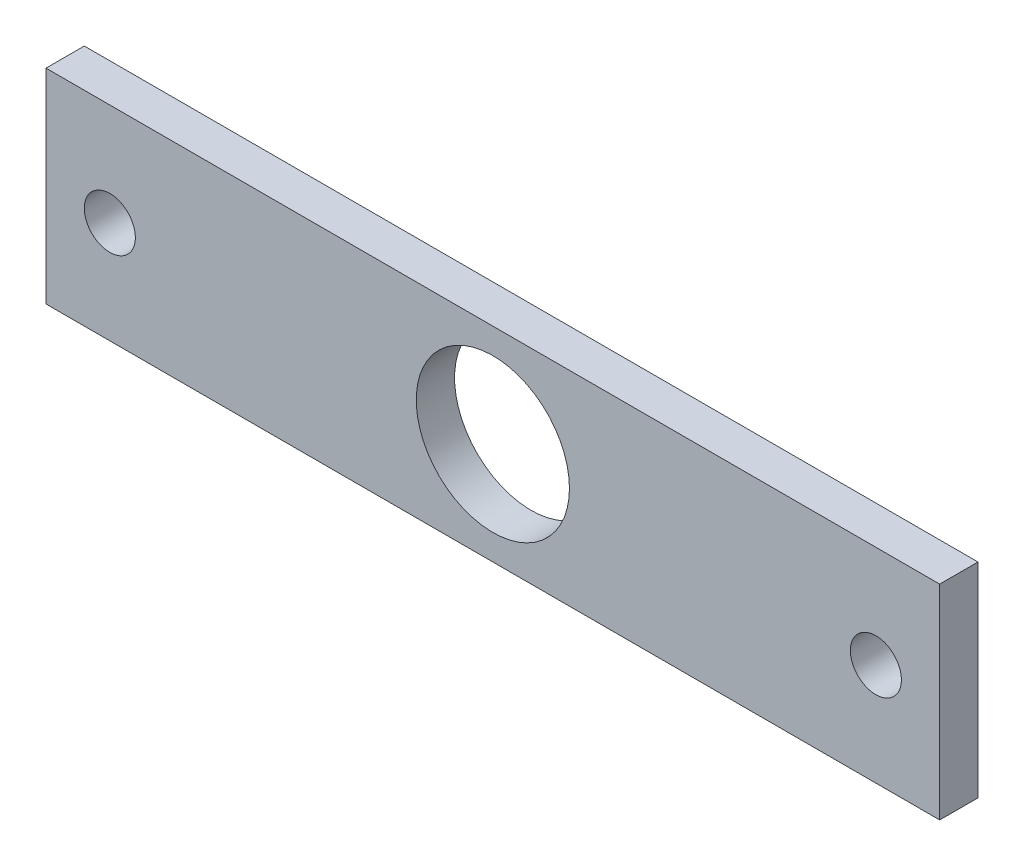
ISO-10303-21;
HEADER;
FILE_DESCRIPTION(('STEP AP214'),'2;1');
FILE_NAME('part.step','',(''),(''),'','','');
FILE_SCHEMA(('AUTOMOTIVE_DESIGN { 1 0 10303 214 1 1 1 1 }'));
ENDSEC;
DATA;
#1=APPLICATION_CONTEXT('core data for automotive mechanical design processes');
#2=APPLICATION_PROTOCOL_DEFINITION('international standard','automotive_design',2000,#1);
#3=PRODUCT_CONTEXT('',#1,'mechanical');
#4=PRODUCT('Part','Part','',(#3));
#5=PRODUCT_RELATED_PRODUCT_CATEGORY('part','',(#4));
#6=PRODUCT_DEFINITION_FORMATION('','',#4);
#7=PRODUCT_DEFINITION_CONTEXT('part definition',#1,'design');
#8=PRODUCT_DEFINITION('design','',#6,#7);
#9=PRODUCT_DEFINITION_SHAPE('','',#8);
#10=(LENGTH_UNIT() NAMED_UNIT(*) SI_UNIT(.MILLI.,.METRE.));
#11=(NAMED_UNIT(*) PLANE_ANGLE_UNIT() SI_UNIT($,.RADIAN.));
#12=(NAMED_UNIT(*) SI_UNIT($,.STERADIAN.) SOLID_ANGLE_UNIT());
#13=UNCERTAINTY_MEASURE_WITH_UNIT(LENGTH_MEASURE(1.E-05),#10,'distance_accuracy_value','');
#14=(GEOMETRIC_REPRESENTATION_CONTEXT(3) GLOBAL_UNCERTAINTY_ASSIGNED_CONTEXT((#13)) GLOBAL_UNIT_ASSIGNED_CONTEXT((#10,
#11,#12)) REPRESENTATION_CONTEXT('',''));
#15=CARTESIAN_POINT('',(0.,0.,0.));
#16=DIRECTION('',(0.,0.,1.));
#17=DIRECTION('',(1.,0.,0.));
#18=AXIS2_PLACEMENT_3D('',#15,#16,#17);
#19=CARTESIAN_POINT('',(175.,-40.,-15.));
#20=DIRECTION('',(1.,0.,0.));
#21=DIRECTION('',(0.,0.,-1.));
#22=AXIS2_PLACEMENT_3D('',#19,#20,#21);
#23=PLANE('',#22);
#24=DIRECTION('',(0.,1.,0.));
#25=VECTOR('',#24,1.);
#26=CARTESIAN_POINT('',(175.,-40.,0.));
#27=LINE('',#26,#25);
#28=CARTESIAN_POINT('',(175.,-40.,0.));
#29=VERTEX_POINT('',#28);
#30=CARTESIAN_POINT('',(175.,40.,0.));
#31=VERTEX_POINT('',#30);
#32=EDGE_CURVE('E98',#29,#31,#27,.T.);
#33=ORIENTED_EDGE('',*,*,#32,.F.);
#34=DIRECTION('',(0.,0.,1.));
#35=VECTOR('',#34,1.);
#36=CARTESIAN_POINT('',(175.,-40.,-15.));
#37=LINE('',#36,#35);
#38=CARTESIAN_POINT('',(175.,-40.,-15.));
#39=VERTEX_POINT('',#38);
#40=EDGE_CURVE('E11',#39,#29,#37,.T.);
#41=ORIENTED_EDGE('',*,*,#40,.F.);
#42=DIRECTION('',(0.,1.,0.));
#43=VECTOR('',#42,1.);
#44=CARTESIAN_POINT('',(175.,-40.,-15.));
#45=LINE('',#44,#43);
#46=CARTESIAN_POINT('',(175.,40.,-15.));
#47=VERTEX_POINT('',#46);
#48=EDGE_CURVE('E91',#39,#47,#45,.T.);
#49=ORIENTED_EDGE('',*,*,#48,.T.);
#50=DIRECTION('',(0.,0.,1.));
#51=VECTOR('',#50,1.);
#52=CARTESIAN_POINT('',(175.,40.,-15.));
#53=LINE('',#52,#51);
#54=EDGE_CURVE('E36',#47,#31,#53,.T.);
#55=ORIENTED_EDGE('',*,*,#54,.T.);
#56=EDGE_LOOP('',(#33,#41,#49,#55));
#57=FACE_BOUND('',#56,.T.);
#58=ADVANCED_FACE('F33',(#57),#23,.T.);
#59=CARTESIAN_POINT('',(-175.,-40.,-15.));
#60=DIRECTION('',(0.,-1.,0.));
#61=DIRECTION('',(0.,0.,-1.));
#62=AXIS2_PLACEMENT_3D('',#59,#60,#61);
#63=PLANE('',#62);
#64=DIRECTION('',(1.,0.,0.));
#65=VECTOR('',#64,1.);
#66=CARTESIAN_POINT('',(-175.,-40.,0.));
#67=LINE('',#66,#65);
#68=CARTESIAN_POINT('',(-175.,-40.,0.));
#69=VERTEX_POINT('',#68);
#70=EDGE_CURVE('E93',#69,#29,#67,.T.);
#71=ORIENTED_EDGE('',*,*,#70,.F.);
#72=DIRECTION('',(0.,0.,1.));
#73=VECTOR('',#72,1.);
#74=CARTESIAN_POINT('',(-175.,-40.,-15.));
#75=LINE('',#74,#73);
#76=CARTESIAN_POINT('',(-175.,-40.,-15.));
#77=VERTEX_POINT('',#76);
#78=EDGE_CURVE('E42',#77,#69,#75,.T.);
#79=ORIENTED_EDGE('',*,*,#78,.F.);
#80=DIRECTION('',(1.,0.,0.));
#81=VECTOR('',#80,1.);
#82=CARTESIAN_POINT('',(-175.,-40.,-15.));
#83=LINE('',#82,#81);
#84=EDGE_CURVE('E88',#77,#39,#83,.T.);
#85=ORIENTED_EDGE('',*,*,#84,.T.);
#86=ORIENTED_EDGE('',*,*,#40,.T.);
#87=EDGE_LOOP('',(#71,#79,#85,#86));
#88=FACE_BOUND('',#87,.T.);
#89=ADVANCED_FACE('F109',(#88),#63,.T.);
#90=CARTESIAN_POINT('',(-175.,-40.,-15.));
#91=DIRECTION('',(-1.,0.,0.));
#92=DIRECTION('',(0.,0.,1.));
#93=AXIS2_PLACEMENT_3D('',#90,#91,#92);
#94=PLANE('',#93);
#95=DIRECTION('',(0.,-1.,0.));
#96=VECTOR('',#95,1.);
#97=CARTESIAN_POINT('',(-175.,-40.,0.));
#98=LINE('',#97,#96);
#99=CARTESIAN_POINT('',(-175.,40.,0.));
#100=VERTEX_POINT('',#99);
#101=EDGE_CURVE('E83',#100,#69,#98,.T.);
#102=ORIENTED_EDGE('',*,*,#101,.F.);
#103=DIRECTION('',(0.,0.,1.));
#104=VECTOR('',#103,1.);
#105=CARTESIAN_POINT('',(-175.,40.,-15.));
#106=LINE('',#105,#104);
#107=CARTESIAN_POINT('',(-175.,40.,-15.));
#108=VERTEX_POINT('',#107);
#109=EDGE_CURVE('E78',#108,#100,#106,.T.);
#110=ORIENTED_EDGE('',*,*,#109,.F.);
#111=DIRECTION('',(0.,-1.,0.));
#112=VECTOR('',#111,1.);
#113=CARTESIAN_POINT('',(-175.,-40.,-15.));
#114=LINE('',#113,#112);
#115=EDGE_CURVE('E81',#108,#77,#114,.T.);
#116=ORIENTED_EDGE('',*,*,#115,.T.);
#117=ORIENTED_EDGE('',*,*,#78,.T.);
#118=EDGE_LOOP('',(#102,#110,#116,#117));
#119=FACE_BOUND('',#118,.T.);
#120=ADVANCED_FACE('F80',(#119),#94,.T.);
#121=CARTESIAN_POINT('',(-175.,40.,-15.));
#122=DIRECTION('',(0.,1.,0.));
#123=DIRECTION('',(-1.,0.,0.));
#124=AXIS2_PLACEMENT_3D('',#121,#122,#123);
#125=PLANE('',#124);
#126=DIRECTION('',(-1.,0.,0.));
#127=VECTOR('',#126,1.);
#128=CARTESIAN_POINT('',(-175.,40.,0.));
#129=LINE('',#128,#127);
#130=EDGE_CURVE('E101',#31,#100,#129,.T.);
#131=ORIENTED_EDGE('',*,*,#130,.F.);
#132=ORIENTED_EDGE('',*,*,#54,.F.);
#133=DIRECTION('',(-1.,0.,0.));
#134=VECTOR('',#133,1.);
#135=CARTESIAN_POINT('',(-175.,40.,-15.));
#136=LINE('',#135,#134);
#137=EDGE_CURVE('E87',#47,#108,#136,.T.);
#138=ORIENTED_EDGE('',*,*,#137,.T.);
#139=ORIENTED_EDGE('',*,*,#109,.T.);
#140=EDGE_LOOP('',(#131,#132,#138,#139));
#141=FACE_BOUND('',#140,.T.);
#142=ADVANCED_FACE('F90',(#141),#125,.T.);
#143=CARTESIAN_POINT('',(0.,0.,-15.));
#144=DIRECTION('',(0.,0.,-1.));
#145=DIRECTION('',(-1.,0.,0.));
#146=AXIS2_PLACEMENT_3D('',#143,#144,#145);
#147=PLANE('',#146);
#148=CARTESIAN_POINT('',(-150.,0.,-15.));
#149=DIRECTION('',(0.,0.,1.));
#150=DIRECTION('',(1.,0.,0.));
#151=AXIS2_PLACEMENT_3D('',#148,#149,#150);
#152=CIRCLE('',#151,9.99999999999998);
#153=CARTESIAN_POINT('',(-140.,0.,-15.));
#154=VERTEX_POINT('',#153);
#155=EDGE_CURVE('E146',#154,#154,#152,.T.);
#156=ORIENTED_EDGE('',*,*,#155,.T.);
#157=EDGE_LOOP('',(#156));
#158=FACE_BOUND('',#157,.T.);
#159=CARTESIAN_POINT('',(150.,0.,-15.));
#160=DIRECTION('',(0.,0.,1.));
#161=DIRECTION('',(1.,0.,0.));
#162=AXIS2_PLACEMENT_3D('',#159,#160,#161);
#163=CIRCLE('',#162,10.);
#164=CARTESIAN_POINT('',(160.,0.,-15.));
#165=VERTEX_POINT('',#164);
#166=EDGE_CURVE('E154',#165,#165,#163,.T.);
#167=ORIENTED_EDGE('',*,*,#166,.T.);
#168=EDGE_LOOP('',(#167));
#169=FACE_BOUND('',#168,.T.);
#170=CARTESIAN_POINT('',(1.11022302462516E-13,0.,-15.));
#171=DIRECTION('',(0.,0.,1.));
#172=DIRECTION('',(1.,0.,0.));
#173=AXIS2_PLACEMENT_3D('',#170,#171,#172);
#174=CIRCLE('',#173,30.);
#175=CARTESIAN_POINT('',(30.0000000000001,0.,-15.));
#176=VERTEX_POINT('',#175);
#177=EDGE_CURVE('E102',#176,#176,#174,.T.);
#178=ORIENTED_EDGE('',*,*,#177,.T.);
#179=EDGE_LOOP('',(#178));
#180=FACE_BOUND('',#179,.T.);
#181=ORIENTED_EDGE('',*,*,#48,.F.);
#182=ORIENTED_EDGE('',*,*,#84,.F.);
#183=ORIENTED_EDGE('',*,*,#115,.F.);
#184=ORIENTED_EDGE('',*,*,#137,.F.);
#185=EDGE_LOOP('',(#181,#182,#183,#184));
#186=FACE_BOUND('',#185,.T.);
#187=ADVANCED_FACE('F86',(#158,#169,#180,#186),#147,.T.);
#188=CARTESIAN_POINT('',(0.,0.,0.));
#189=DIRECTION('',(0.,0.,-1.));
#190=DIRECTION('',(-1.,0.,0.));
#191=AXIS2_PLACEMENT_3D('',#188,#189,#190);
#192=PLANE('',#191);
#193=CARTESIAN_POINT('',(-150.,0.,0.));
#194=DIRECTION('',(0.,0.,1.));
#195=DIRECTION('',(1.,0.,0.));
#196=AXIS2_PLACEMENT_3D('',#193,#194,#195);
#197=CIRCLE('',#196,9.99999999999998);
#198=CARTESIAN_POINT('',(-140.,0.,0.));
#199=VERTEX_POINT('',#198);
#200=EDGE_CURVE('E149',#199,#199,#197,.T.);
#201=ORIENTED_EDGE('',*,*,#200,.F.);
#202=EDGE_LOOP('',(#201));
#203=FACE_BOUND('',#202,.T.);
#204=CARTESIAN_POINT('',(150.,0.,0.));
#205=DIRECTION('',(0.,0.,1.));
#206=DIRECTION('',(1.,0.,0.));
#207=AXIS2_PLACEMENT_3D('',#204,#205,#206);
#208=CIRCLE('',#207,10.);
#209=CARTESIAN_POINT('',(160.,0.,0.));
#210=VERTEX_POINT('',#209);
#211=EDGE_CURVE('E151',#210,#210,#208,.T.);
#212=ORIENTED_EDGE('',*,*,#211,.F.);
#213=EDGE_LOOP('',(#212));
#214=FACE_BOUND('',#213,.T.);
#215=CARTESIAN_POINT('',(1.11022302462516E-13,0.,0.));
#216=DIRECTION('',(0.,0.,1.));
#217=DIRECTION('',(1.,0.,0.));
#218=AXIS2_PLACEMENT_3D('',#215,#216,#217);
#219=CIRCLE('',#218,30.);
#220=CARTESIAN_POINT('',(30.0000000000001,0.,0.));
#221=VERTEX_POINT('',#220);
#222=EDGE_CURVE('E157',#221,#221,#219,.T.);
#223=ORIENTED_EDGE('',*,*,#222,.F.);
#224=EDGE_LOOP('',(#223));
#225=FACE_BOUND('',#224,.T.);
#226=ORIENTED_EDGE('',*,*,#32,.T.);
#227=ORIENTED_EDGE('',*,*,#130,.T.);
#228=ORIENTED_EDGE('',*,*,#101,.T.);
#229=ORIENTED_EDGE('',*,*,#70,.T.);
#230=EDGE_LOOP('',(#226,#227,#228,#229));
#231=FACE_BOUND('',#230,.T.);
#232=ADVANCED_FACE('F108',(#203,#214,#225,#231),#192,.F.);
#233=CARTESIAN_POINT('',(1.11022302462516E-13,0.,-15.));
#234=DIRECTION('',(0.,0.,1.));
#235=DIRECTION('',(1.,0.,0.));
#236=AXIS2_PLACEMENT_3D('',#233,#234,#235);
#237=CYLINDRICAL_SURFACE('',#236,30.);
#238=ORIENTED_EDGE('',*,*,#177,.F.);
#239=EDGE_LOOP('',(#238));
#240=FACE_BOUND('',#239,.T.);
#241=ORIENTED_EDGE('',*,*,#222,.T.);
#242=EDGE_LOOP('',(#241));
#243=FACE_BOUND('',#242,.T.);
#244=ADVANCED_FACE('F127',(#240,#243),#237,.F.);
#245=CARTESIAN_POINT('',(150.,0.,-15.));
#246=DIRECTION('',(0.,0.,1.));
#247=DIRECTION('',(1.,0.,0.));
#248=AXIS2_PLACEMENT_3D('',#245,#246,#247);
#249=CYLINDRICAL_SURFACE('',#248,10.);
#250=ORIENTED_EDGE('',*,*,#166,.F.);
#251=EDGE_LOOP('',(#250));
#252=FACE_BOUND('',#251,.T.);
#253=ORIENTED_EDGE('',*,*,#211,.T.);
#254=EDGE_LOOP('',(#253));
#255=FACE_BOUND('',#254,.T.);
#256=ADVANCED_FACE('F134',(#252,#255),#249,.F.);
#257=CARTESIAN_POINT('',(-150.,0.,-15.));
#258=DIRECTION('',(0.,0.,1.));
#259=DIRECTION('',(1.,0.,0.));
#260=AXIS2_PLACEMENT_3D('',#257,#258,#259);
#261=CYLINDRICAL_SURFACE('',#260,9.99999999999998);
#262=ORIENTED_EDGE('',*,*,#155,.F.);
#263=EDGE_LOOP('',(#262));
#264=FACE_BOUND('',#263,.T.);
#265=ORIENTED_EDGE('',*,*,#200,.T.);
#266=EDGE_LOOP('',(#265));
#267=FACE_BOUND('',#266,.T.);
#268=ADVANCED_FACE('F138',(#264,#267),#261,.F.);
#269=CLOSED_SHELL('',(#58,#89,#120,#142,#187,#232,#244,#256,#268));
#270=MANIFOLD_SOLID_BREP('B2',#269);
#271=ADVANCED_BREP_SHAPE_REPRESENTATION('',(#18,#270),#14);
#272=SHAPE_DEFINITION_REPRESENTATION(#9,#271);
ENDSEC;
END-ISO-10303-21;
